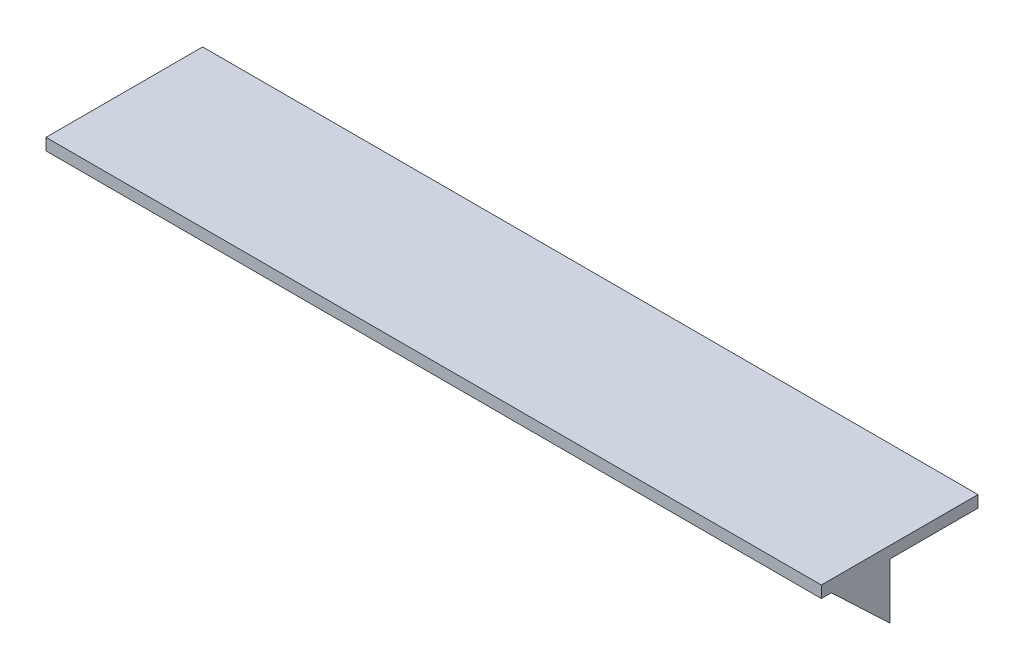
ISO-10303-21;
HEADER;
FILE_DESCRIPTION(('STEP AP214'),'2;1');
FILE_NAME('part.step','',(''),(''),'','','');
FILE_SCHEMA(('AUTOMOTIVE_DESIGN { 1 0 10303 214 1 1 1 1 }'));
ENDSEC;
DATA;
#1=APPLICATION_CONTEXT('core data for automotive mechanical design processes');
#2=APPLICATION_PROTOCOL_DEFINITION('international standard','automotive_design',2000,#1);
#3=PRODUCT_CONTEXT('',#1,'mechanical');
#4=PRODUCT('Part','Part','',(#3));
#5=PRODUCT_RELATED_PRODUCT_CATEGORY('part','',(#4));
#6=PRODUCT_DEFINITION_FORMATION('','',#4);
#7=PRODUCT_DEFINITION_CONTEXT('part definition',#1,'design');
#8=PRODUCT_DEFINITION('design','',#6,#7);
#9=PRODUCT_DEFINITION_SHAPE('','',#8);
#10=(LENGTH_UNIT() NAMED_UNIT(*) SI_UNIT(.MILLI.,.METRE.));
#11=(NAMED_UNIT(*) PLANE_ANGLE_UNIT() SI_UNIT($,.RADIAN.));
#12=(NAMED_UNIT(*) SI_UNIT($,.STERADIAN.) SOLID_ANGLE_UNIT());
#13=UNCERTAINTY_MEASURE_WITH_UNIT(LENGTH_MEASURE(1.E-05),#10,'distance_accuracy_value','');
#14=(GEOMETRIC_REPRESENTATION_CONTEXT(3) GLOBAL_UNCERTAINTY_ASSIGNED_CONTEXT((#13)) GLOBAL_UNIT_ASSIGNED_CONTEXT((#10,
#11,#12)) REPRESENTATION_CONTEXT('',''));
#15=CARTESIAN_POINT('',(0.,0.,0.));
#16=DIRECTION('',(0.,0.,1.));
#17=DIRECTION('',(1.,0.,0.));
#18=AXIS2_PLACEMENT_3D('',#15,#16,#17);
#19=CARTESIAN_POINT('',(0.,0.,0.));
#20=DIRECTION('',(0.,-1.,0.));
#21=DIRECTION('',(0.,0.,-1.));
#22=AXIS2_PLACEMENT_3D('',#19,#20,#21);
#23=PLANE('',#22);
#24=DIRECTION('',(0.,0.,-1.));
#25=VECTOR('',#24,1.);
#26=CARTESIAN_POINT('',(99.,0.,20.));
#27=LINE('',#26,#25);
#28=CARTESIAN_POINT('',(99.,0.,2.52292657424827));
#29=VERTEX_POINT('',#28);
#30=CARTESIAN_POINT('',(99.,0.,-20.));
#31=VERTEX_POINT('',#30);
#32=EDGE_CURVE('E118',#29,#31,#27,.T.);
#33=ORIENTED_EDGE('',*,*,#32,.F.);
#34=DIRECTION('',(-1.,0.,0.));
#35=VECTOR('',#34,1.);
#36=CARTESIAN_POINT('',(99.,0.,2.52292657424827));
#37=LINE('',#36,#35);
#38=CARTESIAN_POINT('',(-99.,0.,2.52292657424827));
#39=VERTEX_POINT('',#38);
#40=EDGE_CURVE('E103',#29,#39,#37,.T.);
#41=ORIENTED_EDGE('',*,*,#40,.T.);
#42=DIRECTION('',(0.,0.,1.));
#43=VECTOR('',#42,1.);
#44=CARTESIAN_POINT('',(-99.,0.,20.));
#45=LINE('',#44,#43);
#46=CARTESIAN_POINT('',(-99.,0.,-20.));
#47=VERTEX_POINT('',#46);
#48=EDGE_CURVE('E132',#47,#39,#45,.T.);
#49=ORIENTED_EDGE('',*,*,#48,.F.);
#50=DIRECTION('',(-1.,0.,0.));
#51=VECTOR('',#50,1.);
#52=CARTESIAN_POINT('',(-99.,0.,-20.));
#53=LINE('',#52,#51);
#54=EDGE_CURVE('E122',#31,#47,#53,.T.);
#55=ORIENTED_EDGE('',*,*,#54,.F.);
#56=EDGE_LOOP('',(#33,#41,#49,#55));
#57=FACE_BOUND('',#56,.T.);
#58=ADVANCED_FACE('F37',(#57),#23,.T.);
#59=CARTESIAN_POINT('',(99.,3.,20.));
#60=DIRECTION('',(-1.,0.,0.));
#61=DIRECTION('',(0.,0.,1.));
#62=AXIS2_PLACEMENT_3D('',#59,#60,#61);
#63=PLANE('',#62);
#64=CARTESIAN_POINT('',(99.,0.,20.));
#65=VERTEX_POINT('',#64);
#66=CARTESIAN_POINT('',(99.,0.,17.4480148460299));
#67=VERTEX_POINT('',#66);
#68=EDGE_CURVE('E123',#65,#67,#27,.T.);
#69=ORIENTED_EDGE('',*,*,#68,.T.);
#70=DIRECTION('',(0.,0.688307365772255,0.725419168635389));
#71=VECTOR('',#70,1.);
#72=CARTESIAN_POINT('',(99.,-14.1615339605561,2.52292657424827));
#73=LINE('',#72,#71);
#74=CARTESIAN_POINT('',(99.,-14.1615339605561,2.52292657424827));
#75=VERTEX_POINT('',#74);
#76=EDGE_CURVE('E113',#75,#67,#73,.T.);
#77=ORIENTED_EDGE('',*,*,#76,.F.);
#78=DIRECTION('',(0.,-1.,0.));
#79=VECTOR('',#78,1.);
#80=CARTESIAN_POINT('',(99.,0.,2.52292657424827));
#81=LINE('',#80,#79);
#82=EDGE_CURVE('E106',#29,#75,#81,.T.);
#83=ORIENTED_EDGE('',*,*,#82,.F.);
#84=ORIENTED_EDGE('',*,*,#32,.T.);
#85=DIRECTION('',(0.,-1.,0.));
#86=VECTOR('',#85,1.);
#87=CARTESIAN_POINT('',(99.,3.,-20.));
#88=LINE('',#87,#86);
#89=CARTESIAN_POINT('',(99.,3.,-20.));
#90=VERTEX_POINT('',#89);
#91=EDGE_CURVE('E11',#90,#31,#88,.T.);
#92=ORIENTED_EDGE('',*,*,#91,.F.);
#93=DIRECTION('',(0.,0.,-1.));
#94=VECTOR('',#93,1.);
#95=CARTESIAN_POINT('',(99.,3.,20.));
#96=LINE('',#95,#94);
#97=CARTESIAN_POINT('',(99.,3.,20.));
#98=VERTEX_POINT('',#97);
#99=EDGE_CURVE('E135',#98,#90,#96,.T.);
#100=ORIENTED_EDGE('',*,*,#99,.F.);
#101=DIRECTION('',(0.,-1.,0.));
#102=VECTOR('',#101,1.);
#103=CARTESIAN_POINT('',(99.,3.,20.));
#104=LINE('',#103,#102);
#105=EDGE_CURVE('E136',#98,#65,#104,.T.);
#106=ORIENTED_EDGE('',*,*,#105,.T.);
#107=EDGE_LOOP('',(#69,#77,#83,#84,#92,#100,#106));
#108=FACE_BOUND('',#107,.T.);
#109=ADVANCED_FACE('F39',(#108),#63,.F.);
#110=CARTESIAN_POINT('',(-99.,3.,-20.));
#111=DIRECTION('',(0.,0.,1.));
#112=DIRECTION('',(1.,0.,0.));
#113=AXIS2_PLACEMENT_3D('',#110,#111,#112);
#114=PLANE('',#113);
#115=ORIENTED_EDGE('',*,*,#54,.T.);
#116=DIRECTION('',(0.,-1.,0.));
#117=VECTOR('',#116,1.);
#118=CARTESIAN_POINT('',(-99.,3.,-20.));
#119=LINE('',#118,#117);
#120=CARTESIAN_POINT('',(-99.,3.,-20.));
#121=VERTEX_POINT('',#120);
#122=EDGE_CURVE('E45',#121,#47,#119,.T.);
#123=ORIENTED_EDGE('',*,*,#122,.F.);
#124=DIRECTION('',(-1.,0.,0.));
#125=VECTOR('',#124,1.);
#126=CARTESIAN_POINT('',(-99.,3.,-20.));
#127=LINE('',#126,#125);
#128=EDGE_CURVE('E89',#90,#121,#127,.T.);
#129=ORIENTED_EDGE('',*,*,#128,.F.);
#130=ORIENTED_EDGE('',*,*,#91,.T.);
#131=EDGE_LOOP('',(#115,#123,#129,#130));
#132=FACE_BOUND('',#131,.T.);
#133=ADVANCED_FACE('F145',(#132),#114,.F.);
#134=CARTESIAN_POINT('',(-99.,3.,20.));
#135=DIRECTION('',(1.,0.,0.));
#136=DIRECTION('',(0.,0.,-1.));
#137=AXIS2_PLACEMENT_3D('',#134,#135,#136);
#138=PLANE('',#137);
#139=ORIENTED_EDGE('',*,*,#48,.T.);
#140=DIRECTION('',(0.,-1.,0.));
#141=VECTOR('',#140,1.);
#142=CARTESIAN_POINT('',(-99.,0.,2.52292657424827));
#143=LINE('',#142,#141);
#144=CARTESIAN_POINT('',(-99.,-14.1615339605561,2.52292657424827));
#145=VERTEX_POINT('',#144);
#146=EDGE_CURVE('E52',#39,#145,#143,.T.);
#147=ORIENTED_EDGE('',*,*,#146,.T.);
#148=DIRECTION('',(0.,0.688307365772255,0.725419168635389));
#149=VECTOR('',#148,1.);
#150=CARTESIAN_POINT('',(-99.,-14.1615339605561,2.52292657424827));
#151=LINE('',#150,#149);
#152=CARTESIAN_POINT('',(-99.,0.,17.4480148460299));
#153=VERTEX_POINT('',#152);
#154=EDGE_CURVE('E120',#145,#153,#151,.T.);
#155=ORIENTED_EDGE('',*,*,#154,.T.);
#156=CARTESIAN_POINT('',(-99.,0.,20.));
#157=VERTEX_POINT('',#156);
#158=EDGE_CURVE('E131',#153,#157,#45,.T.);
#159=ORIENTED_EDGE('',*,*,#158,.T.);
#160=DIRECTION('',(0.,-1.,0.));
#161=VECTOR('',#160,1.);
#162=CARTESIAN_POINT('',(-99.,3.,20.));
#163=LINE('',#162,#161);
#164=CARTESIAN_POINT('',(-99.,3.,20.));
#165=VERTEX_POINT('',#164);
#166=EDGE_CURVE('E138',#165,#157,#163,.T.);
#167=ORIENTED_EDGE('',*,*,#166,.F.);
#168=DIRECTION('',(0.,0.,1.));
#169=VECTOR('',#168,1.);
#170=CARTESIAN_POINT('',(-99.,3.,20.));
#171=LINE('',#170,#169);
#172=EDGE_CURVE('E144',#121,#165,#171,.T.);
#173=ORIENTED_EDGE('',*,*,#172,.F.);
#174=ORIENTED_EDGE('',*,*,#122,.T.);
#175=EDGE_LOOP('',(#139,#147,#155,#159,#167,#173,#174));
#176=FACE_BOUND('',#175,.T.);
#177=ADVANCED_FACE('F142',(#176),#138,.F.);
#178=CARTESIAN_POINT('',(-99.,3.,20.));
#179=DIRECTION('',(0.,0.,-1.));
#180=DIRECTION('',(-1.,0.,0.));
#181=AXIS2_PLACEMENT_3D('',#178,#179,#180);
#182=PLANE('',#181);
#183=DIRECTION('',(1.,0.,0.));
#184=VECTOR('',#183,1.);
#185=CARTESIAN_POINT('',(-99.,0.,20.));
#186=LINE('',#185,#184);
#187=EDGE_CURVE('E82',#157,#65,#186,.T.);
#188=ORIENTED_EDGE('',*,*,#187,.T.);
#189=ORIENTED_EDGE('',*,*,#105,.F.);
#190=DIRECTION('',(1.,0.,0.));
#191=VECTOR('',#190,1.);
#192=CARTESIAN_POINT('',(-99.,3.,20.));
#193=LINE('',#192,#191);
#194=EDGE_CURVE('E61',#165,#98,#193,.T.);
#195=ORIENTED_EDGE('',*,*,#194,.F.);
#196=ORIENTED_EDGE('',*,*,#166,.T.);
#197=EDGE_LOOP('',(#188,#189,#195,#196));
#198=FACE_BOUND('',#197,.T.);
#199=ADVANCED_FACE('F154',(#198),#182,.F.);
#200=CARTESIAN_POINT('',(0.,3.,0.));
#201=DIRECTION('',(0.,-1.,0.));
#202=DIRECTION('',(0.,0.,-1.));
#203=AXIS2_PLACEMENT_3D('',#200,#201,#202);
#204=PLANE('',#203);
#205=ORIENTED_EDGE('',*,*,#99,.T.);
#206=ORIENTED_EDGE('',*,*,#128,.T.);
#207=ORIENTED_EDGE('',*,*,#172,.T.);
#208=ORIENTED_EDGE('',*,*,#194,.T.);
#209=EDGE_LOOP('',(#205,#206,#207,#208));
#210=FACE_BOUND('',#209,.T.);
#211=ADVANCED_FACE('F151',(#210),#204,.F.);
#212=DIRECTION('',(-1.,0.,0.));
#213=VECTOR('',#212,1.);
#214=CARTESIAN_POINT('',(99.,0.,17.4480148460299));
#215=LINE('',#214,#213);
#216=EDGE_CURVE('E124',#67,#153,#215,.T.);
#217=ORIENTED_EDGE('',*,*,#216,.F.);
#218=ORIENTED_EDGE('',*,*,#68,.F.);
#219=ORIENTED_EDGE('',*,*,#187,.F.);
#220=ORIENTED_EDGE('',*,*,#158,.F.);
#221=EDGE_LOOP('',(#217,#218,#219,#220));
#222=FACE_BOUND('',#221,.T.);
#223=ADVANCED_FACE('F161',(#222),#23,.T.);
#224=CARTESIAN_POINT('',(99.,-14.1615339605561,2.52292657424827));
#225=DIRECTION('',(0.,-0.725419168635389,0.688307365772255));
#226=DIRECTION('',(0.,-0.688307365772255,-0.725419168635389));
#227=AXIS2_PLACEMENT_3D('',#224,#225,#226);
#228=PLANE('',#227);
#229=ORIENTED_EDGE('',*,*,#154,.F.);
#230=DIRECTION('',(-1.,0.,0.));
#231=VECTOR('',#230,1.);
#232=CARTESIAN_POINT('',(99.,-14.1615339605561,2.52292657424827));
#233=LINE('',#232,#231);
#234=EDGE_CURVE('E112',#75,#145,#233,.T.);
#235=ORIENTED_EDGE('',*,*,#234,.F.);
#236=ORIENTED_EDGE('',*,*,#76,.T.);
#237=ORIENTED_EDGE('',*,*,#216,.T.);
#238=EDGE_LOOP('',(#229,#235,#236,#237));
#239=FACE_BOUND('',#238,.T.);
#240=ADVANCED_FACE('F170',(#239),#228,.T.);
#241=CARTESIAN_POINT('',(99.,0.,2.52292657424827));
#242=DIRECTION('',(0.,0.,-1.));
#243=DIRECTION('',(-1.,0.,0.));
#244=AXIS2_PLACEMENT_3D('',#241,#242,#243);
#245=PLANE('',#244);
#246=ORIENTED_EDGE('',*,*,#146,.F.);
#247=ORIENTED_EDGE('',*,*,#40,.F.);
#248=ORIENTED_EDGE('',*,*,#82,.T.);
#249=ORIENTED_EDGE('',*,*,#234,.T.);
#250=EDGE_LOOP('',(#246,#247,#248,#249));
#251=FACE_BOUND('',#250,.T.);
#252=ADVANCED_FACE('F105',(#251),#245,.T.);
#253=CLOSED_SHELL('',(#58,#109,#133,#177,#199,#211,#223,#240,#252));
#254=MANIFOLD_SOLID_BREP('B2',#253);
#255=ADVANCED_BREP_SHAPE_REPRESENTATION('',(#18,#254),#14);
#256=SHAPE_DEFINITION_REPRESENTATION(#9,#255);
ENDSEC;
END-ISO-10303-21;
